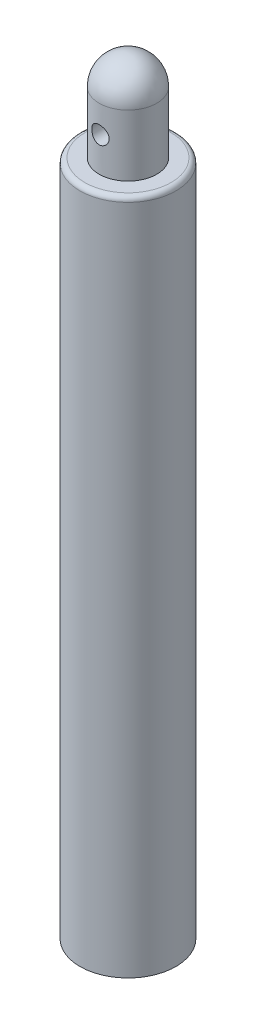
ISO-10303-21;
HEADER;
FILE_DESCRIPTION(('STEP AP214'),'2;1');
FILE_NAME('part.step','',(''),(''),'','','');
FILE_SCHEMA(('AUTOMOTIVE_DESIGN { 1 0 10303 214 1 1 1 1 }'));
ENDSEC;
DATA;
#1=APPLICATION_CONTEXT('core data for automotive mechanical design processes');
#2=APPLICATION_PROTOCOL_DEFINITION('international standard','automotive_design',2000,#1);
#3=PRODUCT_CONTEXT('',#1,'mechanical');
#4=PRODUCT('Part','Part','',(#3));
#5=PRODUCT_RELATED_PRODUCT_CATEGORY('part','',(#4));
#6=PRODUCT_DEFINITION_FORMATION('','',#4);
#7=PRODUCT_DEFINITION_CONTEXT('part definition',#1,'design');
#8=PRODUCT_DEFINITION('design','',#6,#7);
#9=PRODUCT_DEFINITION_SHAPE('','',#8);
#10=(LENGTH_UNIT() NAMED_UNIT(*) SI_UNIT(.MILLI.,.METRE.));
#11=(NAMED_UNIT(*) PLANE_ANGLE_UNIT() SI_UNIT($,.RADIAN.));
#12=(NAMED_UNIT(*) SI_UNIT($,.STERADIAN.) SOLID_ANGLE_UNIT());
#13=UNCERTAINTY_MEASURE_WITH_UNIT(LENGTH_MEASURE(1.E-05),#10,'distance_accuracy_value','');
#14=(GEOMETRIC_REPRESENTATION_CONTEXT(3) GLOBAL_UNCERTAINTY_ASSIGNED_CONTEXT((#13)) GLOBAL_UNIT_ASSIGNED_CONTEXT((#10,
#11,#12)) REPRESENTATION_CONTEXT('',''));
#15=CARTESIAN_POINT('',(0.,0.,0.));
#16=DIRECTION('',(0.,0.,1.));
#17=DIRECTION('',(1.,0.,0.));
#18=AXIS2_PLACEMENT_3D('',#15,#16,#17);
#19=CARTESIAN_POINT('',(0.,69.85,0.));
#20=DIRECTION('',(0.,-1.,0.));
#21=DIRECTION('',(0.,0.,-1.));
#22=AXIS2_PLACEMENT_3D('',#19,#20,#21);
#23=CYLINDRICAL_SURFACE('',#22,4.955);
#24=CARTESIAN_POINT('',(0.,69.35,0.));
#25=DIRECTION('',(0.,1.,0.));
#26=DIRECTION('',(0.,0.,1.));
#27=AXIS2_PLACEMENT_3D('',#24,#25,#26);
#28=CIRCLE('',#27,4.955);
#29=CARTESIAN_POINT('',(0.,69.35,4.955));
#30=VERTEX_POINT('',#29);
#31=EDGE_CURVE('E10',#30,#30,#28,.F.);
#32=ORIENTED_EDGE('',*,*,#31,.T.);
#33=EDGE_LOOP('',(#32));
#34=FACE_BOUND('',#33,.T.);
#35=CARTESIAN_POINT('',(0.,0.,0.));
#36=DIRECTION('',(0.,1.,0.));
#37=DIRECTION('',(0.,0.,1.));
#38=AXIS2_PLACEMENT_3D('',#35,#36,#37);
#39=CIRCLE('',#38,4.955);
#40=CARTESIAN_POINT('',(0.,0.,4.955));
#41=VERTEX_POINT('',#40);
#42=EDGE_CURVE('E48',#41,#41,#39,.T.);
#43=ORIENTED_EDGE('',*,*,#42,.T.);
#44=EDGE_LOOP('',(#43));
#45=FACE_BOUND('',#44,.T.);
#46=ADVANCED_FACE('F33',(#34,#45),#23,.T.);
#47=CARTESIAN_POINT('',(0.,69.85,0.));
#48=DIRECTION('',(0.,1.,0.));
#49=DIRECTION('',(0.,0.,1.));
#50=AXIS2_PLACEMENT_3D('',#47,#48,#49);
#51=PLANE('',#50);
#52=CARTESIAN_POINT('',(0.,69.85,0.));
#53=DIRECTION('',(0.,1.,0.));
#54=DIRECTION('',(0.,0.,1.));
#55=AXIS2_PLACEMENT_3D('',#52,#53,#54);
#56=CIRCLE('',#55,4.455);
#57=CARTESIAN_POINT('',(0.,69.85,4.455));
#58=VERTEX_POINT('',#57);
#59=EDGE_CURVE('E40',#58,#58,#56,.T.);
#60=ORIENTED_EDGE('',*,*,#59,.T.);
#61=EDGE_LOOP('',(#60));
#62=FACE_BOUND('',#61,.T.);
#63=CARTESIAN_POINT('',(0.,69.85,0.));
#64=DIRECTION('',(0.,1.,0.));
#65=DIRECTION('',(0.,0.,1.));
#66=AXIS2_PLACEMENT_3D('',#63,#64,#65);
#67=CIRCLE('',#66,2.975);
#68=CARTESIAN_POINT('',(0.,69.85,2.975));
#69=VERTEX_POINT('',#68);
#70=EDGE_CURVE('E44',#69,#69,#67,.T.);
#71=ORIENTED_EDGE('',*,*,#70,.F.);
#72=EDGE_LOOP('',(#71));
#73=FACE_BOUND('',#72,.T.);
#74=ADVANCED_FACE('F82',(#62,#73),#51,.T.);
#75=CARTESIAN_POINT('',(0.,0.,0.));
#76=DIRECTION('',(0.,1.,0.));
#77=DIRECTION('',(0.,0.,1.));
#78=AXIS2_PLACEMENT_3D('',#75,#76,#77);
#79=PLANE('',#78);
#80=CARTESIAN_POINT('',(0.,0.,0.));
#81=DIRECTION('',(0.,-1.,0.));
#82=DIRECTION('',(0.,0.,-1.));
#83=AXIS2_PLACEMENT_3D('',#80,#81,#82);
#84=CIRCLE('',#83,1.);
#85=CARTESIAN_POINT('',(0.,0.,-1.));
#86=VERTEX_POINT('',#85);
#87=EDGE_CURVE('E109',#86,#86,#84,.T.);
#88=ORIENTED_EDGE('',*,*,#87,.F.);
#89=EDGE_LOOP('',(#88));
#90=FACE_BOUND('',#89,.T.);
#91=ORIENTED_EDGE('',*,*,#42,.F.);
#92=EDGE_LOOP('',(#91));
#93=FACE_BOUND('',#92,.T.);
#94=ADVANCED_FACE('F86',(#90,#93),#79,.F.);
#95=CARTESIAN_POINT('',(0.,76.2,0.));
#96=DIRECTION('',(0.,-1.,0.));
#97=DIRECTION('',(0.,0.,-1.));
#98=AXIS2_PLACEMENT_3D('',#95,#96,#97);
#99=CYLINDRICAL_SURFACE('',#98,2.975);
#100=CARTESIAN_POINT('',(0.,74.29,-2.975));
#101=CARTESIAN_POINT('',(-0.0493538924659117,74.2899994544483,-2.97499960875373));
#102=CARTESIAN_POINT('',(-0.0987133090881732,74.2859268791825,-2.97376015133276));
#103=CARTESIAN_POINT('',(-0.195993540024951,74.269783647307,-2.96893686895155));
#104=CARTESIAN_POINT('',(-0.243913941910268,74.2577107201975,-2.96535237847465));
#105=CARTESIAN_POINT('',(-0.336899028888832,74.2260076534678,-2.95623155593392));
#106=CARTESIAN_POINT('',(-0.381967852646459,74.2063887730066,-2.95069813286341));
#107=CARTESIAN_POINT('',(-0.468176180339112,74.1601972232471,-2.93825382177788));
#108=CARTESIAN_POINT('',(-0.509315140917602,74.1336235942551,-2.93134274369009));
#109=CARTESIAN_POINT('',(-0.587694983809034,74.0734609938962,-2.91665434429983));
#110=CARTESIAN_POINT('',(-0.624805183880234,74.0397061710603,-2.90885904541582));
#111=CARTESIAN_POINT('',(-0.692933845725512,73.9664927728547,-2.89338740323337));
#112=CARTESIAN_POINT('',(-0.72395126131407,73.9270332199476,-2.88571108057228));
#113=CARTESIAN_POINT('',(-0.779705718516785,73.8424196399157,-2.87115579553974));
#114=CARTESIAN_POINT('',(-0.804282507982123,73.7971558186793,-2.86429914298833));
#115=CARTESIAN_POINT('',(-0.845421819673615,73.7028967017116,-2.85242856033148));
#116=CARTESIAN_POINT('',(-0.861986303202129,73.6539023225718,-2.84741417933563));
#117=CARTESIAN_POINT('',(-0.886158181467358,73.555041758686,-2.83998337151754));
#118=CARTESIAN_POINT('',(-0.894006798399969,73.505239941856,-2.83749714916032));
#119=CARTESIAN_POINT('',(-0.901277468543076,73.4049691266538,-2.83519660432944));
#120=CARTESIAN_POINT('',(-0.900701602363047,73.3545002960913,-2.83538162213472));
#121=CARTESIAN_POINT('',(-0.891328963434268,73.2562963766513,-2.83834084649471));
#122=CARTESIAN_POINT('',(-0.88283527634089,73.2085290064907,-2.8410195907651));
#123=CARTESIAN_POINT('',(-0.858358129966997,73.1151317315911,-2.84850987369754));
#124=CARTESIAN_POINT('',(-0.842373920253746,73.069502041518,-2.85332162605089));
#125=CARTESIAN_POINT('',(-0.80314805561763,72.9809378931956,-2.86461134328623));
#126=CARTESIAN_POINT('',(-0.779808726659036,72.9380496472266,-2.87111151271954));
#127=CARTESIAN_POINT('',(-0.726603018030713,72.8566972603875,-2.88503508504516));
#128=CARTESIAN_POINT('',(-0.696735033670319,72.8182342107488,-2.89245871472289));
#129=CARTESIAN_POINT('',(-0.629818174738229,72.7451061041723,-2.90777907465328));
#130=CARTESIAN_POINT('',(-0.592518040084266,72.7106719682301,-2.91568250202471));
#131=CARTESIAN_POINT('',(-0.512574254626524,72.648493410789,-2.93079259157154));
#132=CARTESIAN_POINT('',(-0.469930256342886,72.6207494246544,-2.93799920838343));
#133=CARTESIAN_POINT('',(-0.380084529400247,72.5725952965835,-2.95097140817586));
#134=CARTESIAN_POINT('',(-0.332853347365435,72.5522371477327,-2.95672669120734));
#135=CARTESIAN_POINT('',(-0.23542279639094,72.5198219207802,-2.96607351032513));
#136=CARTESIAN_POINT('',(-0.18522427427138,72.5077624866903,-2.96966566048424));
#137=CARTESIAN_POINT('',(-0.085246511826073,72.4926732298193,-2.97418401441247));
#138=CARTESIAN_POINT('',(-0.0355185981495156,72.4893305123255,-2.97520255673052));
#139=CARTESIAN_POINT('',(0.0637912694267338,72.4908915413013,-2.97473027115334));
#140=CARTESIAN_POINT('',(0.113373242254575,72.4957941664765,-2.97323978446411));
#141=CARTESIAN_POINT('',(0.209797655374504,72.5134540656328,-2.96797740679089));
#142=CARTESIAN_POINT('',(0.256676890086767,72.5260278411683,-2.96425884870936));
#143=CARTESIAN_POINT('',(0.347649547904485,72.5584517205736,-2.95497163819599));
#144=CARTESIAN_POINT('',(0.391742633391964,72.5783027043008,-2.94940276205738));
#145=CARTESIAN_POINT('',(0.477037386490417,72.6252384294981,-2.9368288294005));
#146=CARTESIAN_POINT('',(0.518147298658479,72.6524815110455,-2.92979322678919));
#147=CARTESIAN_POINT('',(0.595318261473104,72.7132361808543,-2.91509295242122));
#148=CARTESIAN_POINT('',(0.631378021591701,72.746749366301,-2.90742812066067));
#149=CARTESIAN_POINT('',(0.698807247989637,72.8205633730886,-2.89197778519192));
#150=CARTESIAN_POINT('',(0.729954013874499,72.8610693366059,-2.88419829726305));
#151=CARTESIAN_POINT('',(0.785024689250296,72.9469020994603,-2.86969947116052));
#152=CARTESIAN_POINT('',(0.808948774720891,72.9922287813048,-2.86298010715898));
#153=CARTESIAN_POINT('',(0.848733962083619,73.0862813704306,-2.85143919210159));
#154=CARTESIAN_POINT('',(0.864631486034764,73.1349907606885,-2.8466090910791));
#155=CARTESIAN_POINT('',(0.887949153883874,73.2345691072449,-2.83942301524453));
#156=CARTESIAN_POINT('',(0.895372265579273,73.2854373010387,-2.83706617430313));
#157=CARTESIAN_POINT('',(0.901326335754701,73.3855729009132,-2.83517978487256));
#158=CARTESIAN_POINT('',(0.900220779370863,73.4348167962997,-2.83553465892088));
#159=CARTESIAN_POINT('',(0.890018490290975,73.5323819146612,-2.83875325855457));
#160=CARTESIAN_POINT('',(0.880922087759302,73.580703175673,-2.84161688048393));
#161=CARTESIAN_POINT('',(0.855232722777554,73.6744461057478,-2.84945213767348));
#162=CARTESIAN_POINT('',(0.838737545840673,73.7198970454942,-2.85439622546337));
#163=CARTESIAN_POINT('',(0.798795152767589,73.8074226059383,-2.86582987688364));
#164=CARTESIAN_POINT('',(0.775346588832439,73.8494965700544,-2.87231974008897));
#165=CARTESIAN_POINT('',(0.721148187603958,73.9307566591937,-2.88641312873204));
#166=CARTESIAN_POINT('',(0.690160478204201,73.9697785223715,-2.89404895525363));
#167=CARTESIAN_POINT('',(0.622189657329324,74.0421862182664,-2.90941872543171));
#168=CARTESIAN_POINT('',(0.58520498104082,74.0755705753118,-2.91715269421005));
#169=CARTESIAN_POINT('',(0.504958339869317,74.1367513517762,-2.93212463120724));
#170=CARTESIAN_POINT('',(0.461541738984861,74.1643508277354,-2.93934085246687));
#171=CARTESIAN_POINT('',(0.370466289167445,74.21182041724,-2.95220076642398));
#172=CARTESIAN_POINT('',(0.322809374500798,74.231694033034,-2.95784517131951));
#173=CARTESIAN_POINT('',(0.229661135845262,74.2614329575482,-2.9664523879998));
#174=CARTESIAN_POINT('',(0.184449673828996,74.272116208598,-2.96963098967094));
#175=CARTESIAN_POINT('',(0.0928269632958508,74.2863993709775,-2.97390479864906));
#176=CARTESIAN_POINT('',(0.046415924668691,74.2900005130757,-2.97500036795593));
#177=CARTESIAN_POINT('',(0.,74.29,-2.975));
#178=B_SPLINE_CURVE_WITH_KNOTS('',3,(#100,#101,#102,#103,#104,#105,#106,#107,#108,#109,#110,
#111,#112,#113,#114,#115,#116,#117,#118,#119,#120,#121,#122,#123,#124,#125,#126,#127,#128,#129,
#130,#131,#132,#133,#134,#135,#136,#137,#138,#139,#140,#141,#142,#143,#144,#145,#146,#147,#148,
#149,#150,#151,#152,#153,#154,#155,#156,#157,#158,#159,#160,#161,#162,#163,#164,#165,#166,#167,
#168,#169,#170,#171,#172,#173,#174,#175,#176,#177),.UNSPECIFIED.,.T.,.F.,(4,2,2,2,2,2,2,2,2,2,2,
2,2,2,2,2,2,2,2,2,2,2,2,2,2,2,2,2,2,2,2,2,2,2,2,2,2,2,4),(0.,0.147891158625831,
0.295824306745459,0.443537577853369,0.591271242840275,0.742883169478673,0.894521106526044,
1.04963481563183,1.2047105357944,1.35537821451222,1.50600868319566,1.65110002602045,
1.7962059078279,1.94332628785269,2.09048286962013,2.24389428119289,2.39731567338399,
2.5517970384032,2.7062345283646,2.85504679675063,3.00383882960454,3.14920407836804,
3.29458690844883,3.44337030748751,3.59219165788802,3.74651522572482,3.90083503318464,
4.05444814572996,4.20800744538858,4.3550594953227,4.50210546967183,4.64726280304184,
4.79244829116965,4.943001106331,5.09359326926706,5.2486884987661,5.40371333905262,
5.5428249227541,5.68191232873091),.UNSPECIFIED.);
#179=CARTESIAN_POINT('',(0.,74.29,-2.975));
#180=VERTEX_POINT('',#179);
#181=EDGE_CURVE('E60',#180,#180,#178,.T.);
#182=ORIENTED_EDGE('',*,*,#181,.T.);
#183=EDGE_LOOP('',(#182));
#184=FACE_BOUND('',#183,.T.);
#185=CARTESIAN_POINT('',(0.899999999999999,73.39,2.83559958386229));
#186=CARTESIAN_POINT('',(0.899999439432204,73.3407044494433,2.83560005632211));
#187=CARTESIAN_POINT('',(0.895936145447259,73.2914033554005,2.83689912052607));
#188=CARTESIAN_POINT('',(0.879833118656581,73.1942439281369,2.84193381760332));
#189=CARTESIAN_POINT('',(0.867790823425812,73.1463860635674,2.84567023321651));
#190=CARTESIAN_POINT('',(0.836177226741544,73.0535338654722,2.85511856244178));
#191=CARTESIAN_POINT('',(0.8166186056534,73.0085348571287,2.86082714728961));
#192=CARTESIAN_POINT('',(0.770569352000035,72.922445480287,2.8735720703129));
#193=CARTESIAN_POINT('',(0.744077643885241,72.8813557195914,2.8806086144512));
#194=CARTESIAN_POINT('',(0.684001338517167,72.8029287949999,2.89547059850883));
#195=CARTESIAN_POINT('',(0.650232418654725,72.7657360178587,2.90331306078141));
#196=CARTESIAN_POINT('',(0.576955153735612,72.6974455959251,2.91875793344252));
#197=CARTESIAN_POINT('',(0.537446059737952,72.6663487477359,2.92636031234871));
#198=CARTESIAN_POINT('',(0.452780748946194,72.6105039068376,2.94066206214821));
#199=CARTESIAN_POINT('',(0.407523120287281,72.5859034260449,2.9473390418085));
#200=CARTESIAN_POINT('',(0.31327685407504,72.5447186919514,2.95883970584629));
#201=CARTESIAN_POINT('',(0.264289038211678,72.5281326790937,2.96366379697322));
#202=CARTESIAN_POINT('',(0.165483785585558,72.503926369228,2.97079468610525));
#203=CARTESIAN_POINT('',(0.115731819189544,72.4960595521602,2.97317055802265));
#204=CARTESIAN_POINT('',(0.0155612380145653,72.4887351298804,2.97538070543984));
#205=CARTESIAN_POINT('',(-0.0348572321613802,72.4892757295895,2.97521552348352));
#206=CARTESIAN_POINT('',(-0.133199052475373,72.4985859798233,2.97241085498226));
#207=CARTESIAN_POINT('',(-0.181150333317985,72.5070886142764,2.9698516573841));
#208=CARTESIAN_POINT('',(-0.274910436628302,72.5316450148913,2.96264432445602));
#209=CARTESIAN_POINT('',(-0.320719122350959,72.5476992622923,2.9579960559974));
#210=CARTESIAN_POINT('',(-0.409524704956143,72.5870821234925,2.94702251063879));
#211=CARTESIAN_POINT('',(-0.452482164400859,72.6104941266448,2.94067814062821));
#212=CARTESIAN_POINT('',(-0.533943623515148,72.6638617701451,2.92698444053846));
#213=CARTESIAN_POINT('',(-0.572446549082189,72.6938189837025,2.91963486900777));
#214=CARTESIAN_POINT('',(-0.645499230650431,72.7608087406788,2.90437665711018));
#215=CARTESIAN_POINT('',(-0.679835056469484,72.7980724684774,2.89645739440677));
#216=CARTESIAN_POINT('',(-0.741831422856004,72.877905601668,2.88120341445876));
#217=CARTESIAN_POINT('',(-0.769491276542101,72.920475552327,2.87386875741537));
#218=CARTESIAN_POINT('',(-0.817578712566594,73.0102841512614,2.86056312073841));
#219=CARTESIAN_POINT('',(-0.837932017963144,73.057564830894,2.85460635388627));
#220=CARTESIAN_POINT('',(-0.870323390132549,73.1551050517514,2.84489919202199));
#221=CARTESIAN_POINT('',(-0.882364223605043,73.2053635957789,2.8411480629533));
#222=CARTESIAN_POINT('',(-0.897386428270994,73.3053941388825,2.83643836759132));
#223=CARTESIAN_POINT('',(-0.900693472382804,73.3551125431071,2.83537946990161));
#224=CARTESIAN_POINT('',(-0.899064640164192,73.4543957020626,2.83589646716383));
#225=CARTESIAN_POINT('',(-0.894129941073505,73.5039604777246,2.83747198581925));
#226=CARTESIAN_POINT('',(-0.876447940239687,73.6001623818805,2.84298170763835));
#227=CARTESIAN_POINT('',(-0.863911561966481,73.6468423018188,2.84685217097459));
#228=CARTESIAN_POINT('',(-0.831627246304974,73.7374325941848,2.85644934235893));
#229=CARTESIAN_POINT('',(-0.811878182713559,73.7813425328457,2.86217634027434));
#230=CARTESIAN_POINT('',(-0.765114771623089,73.866467892648,2.87503496179511));
#231=CARTESIAN_POINT('',(-0.737917353529593,73.9075774823701,2.88220056581329));
#232=CARTESIAN_POINT('',(-0.677245939756587,73.9847681715829,2.89705655363179));
#233=CARTESIAN_POINT('',(-0.643770416189823,74.0208480432692,2.90474706488711));
#234=CARTESIAN_POINT('',(-0.569959971706968,74.0883855878864,2.92014438130891));
#235=CARTESIAN_POINT('',(-0.529410712279684,74.1196120499769,2.92784043189515));
#236=CARTESIAN_POINT('',(-0.443463705219728,74.1748236098805,2.94208421569404));
#237=CARTESIAN_POINT('',(-0.398066195358067,74.1988090625915,2.94863200517887));
#238=CARTESIAN_POINT('',(-0.304007891541728,74.2386263478964,2.95980197874116));
#239=CARTESIAN_POINT('',(-0.255374538355256,74.254518797374,2.96443842737107));
#240=CARTESIAN_POINT('',(-0.155961676531769,74.2778517454447,2.97132626816909));
#241=CARTESIAN_POINT('',(-0.105182797767729,74.2852947069596,2.97357835533638));
#242=CARTESIAN_POINT('',(-0.00505534621600697,74.2913275384831,2.97540066790667));
#243=CARTESIAN_POINT('',(0.0442714418049871,74.2902524408026,2.97507238843757));
#244=CARTESIAN_POINT('',(0.142010714413318,74.280082432429,2.97201084272341));
#245=CARTESIAN_POINT('',(0.190423252184667,74.2709879897164,2.96927771681667));
#246=CARTESIAN_POINT('',(0.284436446612657,74.2452460209724,2.96174314703705));
#247=CARTESIAN_POINT('',(0.33006231554837,74.2286832999051,2.9569649557481));
#248=CARTESIAN_POINT('',(0.417911025632378,74.1885509170689,2.94583403134336));
#249=CARTESIAN_POINT('',(0.460133300836504,74.1649800930462,2.93948103708455));
#250=CARTESIAN_POINT('',(0.541463029932274,74.1106158497221,2.92561117155489));
#251=CARTESIAN_POINT('',(0.580425300944534,74.079613221024,2.91806326757861));
#252=CARTESIAN_POINT('',(0.652706224922244,74.0116406218517,2.90275167893282));
#253=CARTESIAN_POINT('',(0.686023234256751,73.9746689195655,2.89498793218346));
#254=CARTESIAN_POINT('',(0.747088049592021,73.8944565561567,2.87984479836746));
#255=CARTESIAN_POINT('',(0.774635320969892,73.8510592533666,2.87248432047409));
#256=CARTESIAN_POINT('',(0.822011930836993,73.7600349383991,2.85928831601298));
#257=CARTESIAN_POINT('',(0.84184486361977,73.7124099087546,2.85345207968237));
#258=CARTESIAN_POINT('',(0.871509812944171,73.6193544361324,2.84452287201841));
#259=CARTESIAN_POINT('',(0.882163814140702,73.5742061743084,2.84120866250692));
#260=CARTESIAN_POINT('',(0.896408432995147,73.4827067399985,2.83674702275044));
#261=CARTESIAN_POINT('',(0.900000527138454,73.4363558210149,2.83559913957751));
#262=CARTESIAN_POINT('',(0.899999999999999,73.39,2.83559958386229));
#263=B_SPLINE_CURVE_WITH_KNOTS('',3,(#185,#186,#187,#188,#189,#190,#191,#192,#193,#194,#195,
#196,#197,#198,#199,#200,#201,#202,#203,#204,#205,#206,#207,#208,#209,#210,#211,#212,#213,#214,
#215,#216,#217,#218,#219,#220,#221,#222,#223,#224,#225,#226,#227,#228,#229,#230,#231,#232,#233,
#234,#235,#236,#237,#238,#239,#240,#241,#242,#243,#244,#245,#246,#247,#248,#249,#250,#251,#252,
#253,#254,#255,#256,#257,#258,#259,#260,#261,#262),.UNSPECIFIED.,.T.,.F.,(4,2,2,2,2,2,2,2,2,2,2,
2,2,2,2,2,2,2,2,2,2,2,2,2,2,2,2,2,2,2,2,2,2,2,2,2,2,2,4),(0.,0.147715604944634,
0.295478671185687,0.442993541413566,0.59053130962339,0.742371811289511,0.894232141948245,
1.04929090564767,1.2043156110882,1.35483562846839,1.5053235085596,1.65093872572673,
1.79656322372571,1.94390159752386,2.09127542466833,2.24442209436204,2.39758451439025,
2.55226258311801,2.70688914438179,2.8556626682439,3.00441494330935,3.1492174698854,
3.2940426158908,3.44280855031748,3.59161073664006,3.74613731846476,3.90065632537473,
4.05400029804457,4.20729956134331,4.35460009134372,4.50189202597708,4.64755196010528,
4.79323606459042,4.9436388253527,5.0940853012594,5.24911407551795,5.40407053141781,
5.54300619947486,5.68191281612862),.UNSPECIFIED.);
#264=CARTESIAN_POINT('',(0.899999999999999,73.39,2.83559958386229));
#265=VERTEX_POINT('',#264);
#266=EDGE_CURVE('E59',#265,#265,#263,.T.);
#267=ORIENTED_EDGE('',*,*,#266,.T.);
#268=EDGE_LOOP('',(#267));
#269=FACE_BOUND('',#268,.T.);
#270=CARTESIAN_POINT('',(0.,76.2,0.));
#271=DIRECTION('',(0.,1.,0.));
#272=DIRECTION('',(0.,0.,1.));
#273=AXIS2_PLACEMENT_3D('',#270,#271,#272);
#274=CIRCLE('',#273,2.975);
#275=CARTESIAN_POINT('',(0.,76.2,2.975));
#276=VERTEX_POINT('',#275);
#277=EDGE_CURVE('E105',#276,#276,#274,.T.);
#278=ORIENTED_EDGE('',*,*,#277,.F.);
#279=EDGE_LOOP('',(#278));
#280=FACE_BOUND('',#279,.T.);
#281=ORIENTED_EDGE('',*,*,#70,.T.);
#282=EDGE_LOOP('',(#281));
#283=FACE_BOUND('',#282,.T.);
#284=ADVANCED_FACE('F91',(#184,#269,#280,#283),#99,.T.);
#285=CARTESIAN_POINT('',(0.,20.,0.));
#286=DIRECTION('',(0.,-1.,0.));
#287=DIRECTION('',(0.,0.,-1.));
#288=AXIS2_PLACEMENT_3D('',#285,#286,#287);
#289=CYLINDRICAL_SURFACE('',#288,1.);
#290=CARTESIAN_POINT('',(0.,20.,0.));
#291=DIRECTION('',(0.,-1.,0.));
#292=DIRECTION('',(0.,0.,-1.));
#293=AXIS2_PLACEMENT_3D('',#290,#291,#292);
#294=CIRCLE('',#293,1.);
#295=CARTESIAN_POINT('',(0.,20.,-1.));
#296=VERTEX_POINT('',#295);
#297=EDGE_CURVE('E108',#296,#296,#294,.T.);
#298=ORIENTED_EDGE('',*,*,#297,.F.);
#299=EDGE_LOOP('',(#298));
#300=FACE_BOUND('',#299,.T.);
#301=ORIENTED_EDGE('',*,*,#87,.T.);
#302=EDGE_LOOP('',(#301));
#303=FACE_BOUND('',#302,.T.);
#304=ADVANCED_FACE('F96',(#300,#303),#289,.F.);
#305=CARTESIAN_POINT('',(0.,20.,0.));
#306=DIRECTION('',(0.,-1.,0.));
#307=DIRECTION('',(0.,0.,-1.));
#308=AXIS2_PLACEMENT_3D('',#305,#306,#307);
#309=PLANE('',#308);
#310=ORIENTED_EDGE('',*,*,#297,.T.);
#311=EDGE_LOOP('',(#310));
#312=FACE_BOUND('',#311,.T.);
#313=ADVANCED_FACE('F115',(#312),#309,.T.);
#314=CARTESIAN_POINT('',(0.,73.39,-4.955));
#315=DIRECTION('',(0.,0.,1.));
#316=DIRECTION('',(1.,0.,0.));
#317=AXIS2_PLACEMENT_3D('',#314,#315,#316);
#318=CYLINDRICAL_SURFACE('',#317,0.899999999999999);
#319=CARTESIAN_POINT('',(0.899632523568646,73.3642838078292,0.));
#320=CARTESIAN_POINT('',(0.899634088262646,73.3642846054179,-0.076102913289735));
#321=CARTESIAN_POINT('',(0.899737574803172,73.3673837191333,-0.152231479451245));
#322=CARTESIAN_POINT('',(0.899961509341407,73.37970414633,-0.304022426939057));
#323=CARTESIAN_POINT('',(0.90008196788897,73.3889292811111,-0.379684487516651));
#324=CARTESIAN_POINT('',(0.899780645912804,73.4133096354593,-0.530296545836144));
#325=CARTESIAN_POINT('',(0.899357105936551,73.4284839860742,-0.605243439271529));
#326=CARTESIAN_POINT('',(0.89710003108189,73.4643953989738,-0.753750413174285));
#327=CARTESIAN_POINT('',(0.895266852445882,73.4851310549494,-0.827310839216956));
#328=CARTESIAN_POINT('',(0.889494065466864,73.528617489136,-0.963087244761712));
#329=CARTESIAN_POINT('',(0.885864694726194,73.5507402572079,-1.02551820190751));
#330=CARTESIAN_POINT('',(0.875868212586727,73.5984442003527,-1.14881693909608));
#331=CARTESIAN_POINT('',(0.869501592829798,73.6240247538015,-1.20968499777412));
#332=CARTESIAN_POINT('',(0.853106821560963,73.6781057439446,-1.32937916738041));
#333=CARTESIAN_POINT('',(0.843090515553861,73.7065965222488,-1.3882112175344));
#334=CARTESIAN_POINT('',(0.818339012917693,73.7659725518043,-1.50360074063423));
#335=CARTESIAN_POINT('',(0.803607477880371,73.7968559310325,-1.56015994031989));
#336=CARTESIAN_POINT('',(0.767837091240347,73.8609610563359,-1.67167612015994));
#337=CARTESIAN_POINT('',(0.746668030770805,73.8942190510098,-1.72657150054248));
#338=CARTESIAN_POINT('',(0.696679637857359,73.9613029192311,-1.83249677185712));
#339=CARTESIAN_POINT('',(0.667862118877974,73.9951286563872,-1.8835275754063));
#340=CARTESIAN_POINT('',(0.607392862566376,74.0552278047536,-1.97094891803156));
#341=CARTESIAN_POINT('',(0.577325355426825,74.0817129622614,-2.00827702210747));
#342=CARTESIAN_POINT('',(0.510399348142647,74.1324610137881,-2.07806798470387));
#343=CARTESIAN_POINT('',(0.473554607355382,74.1567282638761,-2.11054046336246));
#344=CARTESIAN_POINT('',(0.404341900109814,74.194727634953,-2.16044666076909));
#345=CARTESIAN_POINT('',(0.373726962428657,74.2094838578533,-2.17952112966812));
#346=CARTESIAN_POINT('',(0.309019375803281,74.2360062923557,-2.21345158709295));
#347=CARTESIAN_POINT('',(0.274928445677037,74.247773971788,-2.22830964694073));
#348=CARTESIAN_POINT('',(0.203489718862358,74.2674828238116,-2.25302792555032));
#349=CARTESIAN_POINT('',(0.166113050314495,74.2753850075873,-2.26283727065471));
#350=CARTESIAN_POINT('',(0.0895957378834002,74.2863593702473,-2.2764255330879));
#351=CARTESIAN_POINT('',(0.0504571200527109,74.2894369579786,-2.28021120362035));
#352=CARTESIAN_POINT('',(-0.0221797685135232,74.290349806225,-2.28133500843057));
#353=CARTESIAN_POINT('',(-0.0556599848381693,74.2888902473288,-2.27954043219711));
#354=CARTESIAN_POINT('',(-0.1217055556917,74.2823499557444,-2.27146384085728));
#355=CARTESIAN_POINT('',(-0.154270905539243,74.2772692045302,-2.26518180279306));
#356=CARTESIAN_POINT('',(-0.216776093831129,74.2640725481825,-2.24875012191265));
#357=CARTESIAN_POINT('',(-0.246762773864745,74.2560411396822,-2.23870801408249));
#358=CARTESIAN_POINT('',(-0.304537803409586,74.2374546072217,-2.21525563593057));
#359=CARTESIAN_POINT('',(-0.332325348511707,74.226898565417,-2.20184414055932));
#360=CARTESIAN_POINT('',(-0.398137401122539,74.1982808222611,-2.16507287901919));
#361=CARTESIAN_POINT('',(-0.43470749238058,74.1790430924701,-2.14002191839141));
#362=CARTESIAN_POINT('',(-0.502339458433708,74.1378183345274,-2.0851907935858));
#363=CARTESIAN_POINT('',(-0.533388054917802,74.1158248899739,-2.05539954695141));
#364=CARTESIAN_POINT('',(-0.604208545047913,74.0592353437494,-1.9768214085981));
#365=CARTESIAN_POINT('',(-0.640830496378168,74.0237320430423,-1.92586526808335));
#366=CARTESIAN_POINT('',(-0.704383535863703,73.9522609436463,-1.81860548569918));
#367=CARTESIAN_POINT('',(-0.73129733042556,73.9162924331263,-1.76229252469608));
#368=CARTESIAN_POINT('',(-0.773285041327692,73.8517797131977,-1.65591330181651));
#369=CARTESIAN_POINT('',(-0.789601313750761,73.823026730185,-1.6064494538395));
#370=CARTESIAN_POINT('',(-0.817798011834255,73.7670766006082,-1.50540874501755));
#371=CARTESIAN_POINT('',(-0.829675568256259,73.7398804699956,-1.45383054124632));
#372=CARTESIAN_POINT('',(-0.859974937789043,73.661318989007,-1.29628140471858));
#373=CARTESIAN_POINT('',(-0.873000877387843,73.6130905152329,-1.18767347338055));
#374=CARTESIAN_POINT('',(-0.887784425724307,73.5408279622423,-0.999112730332888));
#375=CARTESIAN_POINT('',(-0.891754648326795,73.5138823495086,-0.920385555252119));
#376=CARTESIAN_POINT('',(-0.897092228282405,73.4661847773202,-0.760939667062752));
#377=CARTESIAN_POINT('',(-0.898458742327469,73.4454348263959,-0.68022031728582));
#378=CARTESIAN_POINT('',(-0.899928140002291,73.4107532316111,-0.517466529301141));
#379=CARTESIAN_POINT('',(-0.900033199262823,73.3968098882658,-0.435434599728592));
#380=CARTESIAN_POINT('',(-0.899952804501816,73.3760916514885,-0.270478513641278));
#381=CARTESIAN_POINT('',(-0.899767406132918,73.3693153852375,-0.187554531070039));
#382=CARTESIAN_POINT('',(-0.899604786269482,73.3631481944578,-0.0217077738184924));
#383=CARTESIAN_POINT('',(-0.899626871998157,73.3637326950009,0.061214081072949));
#384=CARTESIAN_POINT('',(-0.899833852757138,73.372209389237,0.226690463910219));
#385=CARTESIAN_POINT('',(-0.90001876735393,73.3801024611772,0.309244946512127));
#386=CARTESIAN_POINT('',(-0.899978592143726,73.4029799742356,0.473536384970677));
#387=CARTESIAN_POINT('',(-0.899752632016177,73.4179794183949,0.5552712358415));
#388=CARTESIAN_POINT('',(-0.89786270052123,73.454644112636,0.717202141520554));
#389=CARTESIAN_POINT('',(-0.896198957269398,73.476308304952,0.797398438369335));
#390=CARTESIAN_POINT('',(-0.890628276214318,73.5211099978689,0.941019773621992));
#391=CARTESIAN_POINT('',(-0.887197034230405,73.5432209604041,1.00478566782372));
#392=CARTESIAN_POINT('',(-0.877590062610097,73.591076235799,1.13072375343631));
#393=CARTESIAN_POINT('',(-0.871414880437171,73.6168198231885,1.19289626013967));
#394=CARTESIAN_POINT('',(-0.855353765548068,73.6713829414206,1.31515061268184));
#395=CARTESIAN_POINT('',(-0.84548009685262,73.7001920834379,1.37523865881723));
#396=CARTESIAN_POINT('',(-0.820915299729635,73.7603418118653,1.49308855291835));
#397=CARTESIAN_POINT('',(-0.806227952517099,73.7916803968441,1.5508521868853));
#398=CARTESIAN_POINT('',(-0.770713083795509,73.8562233962197,1.66369889603867));
#399=CARTESIAN_POINT('',(-0.749864777965999,73.889433813367,1.71877215012738));
#400=CARTESIAN_POINT('',(-0.700584351229797,73.9564917586034,1.82511038893037));
#401=CARTESIAN_POINT('',(-0.672153365025929,73.9903391906634,1.87637594197809));
#402=CARTESIAN_POINT('',(-0.612133003823431,74.0508827332475,1.96475798105191));
#403=CARTESIAN_POINT('',(-0.582046782479774,74.0777643353465,2.00275591849616));
#404=CARTESIAN_POINT('',(-0.514950170162422,74.1293298141437,2.07384048857992));
#405=CARTESIAN_POINT('',(-0.477954169893062,74.1540181038567,2.10693707674727));
#406=CARTESIAN_POINT('',(-0.408571393332795,74.1925893066954,2.1576660182547));
#407=CARTESIAN_POINT('',(-0.378009743180878,74.2075188247406,2.17698818489116));
#408=CARTESIAN_POINT('',(-0.313366824648113,74.2344073000309,2.21142264872647));
#409=CARTESIAN_POINT('',(-0.279287247677723,74.2463676755006,2.22653695624937));
#410=CARTESIAN_POINT('',(-0.207809451188721,74.2664730257626,2.25176959201895));
#411=CARTESIAN_POINT('',(-0.170381392453746,74.2745785570721,2.26183632694393));
#412=CARTESIAN_POINT('',(-0.0936951711280377,74.2859448439896,2.27591455010336));
#413=CARTESIAN_POINT('',(-0.0544391794158992,74.2892112025756,2.27993304131009));
#414=CARTESIAN_POINT('',(0.0184234566652055,74.2904375496844,2.28144313241411));
#415=CARTESIAN_POINT('',(0.0520040159104691,74.2891130199651,2.279814764043));
#416=CARTESIAN_POINT('',(0.118280619585325,74.2828141947941,2.27203781546533));
#417=CARTESIAN_POINT('',(0.150976666405507,74.2778399092077,2.26588924747687));
#418=CARTESIAN_POINT('',(0.213638483072572,74.2648445903672,2.24971413626359));
#419=CARTESIAN_POINT('',(0.24365695114046,74.2569203901122,2.23981067677437));
#420=CARTESIAN_POINT('',(0.301514639649818,74.2385352163407,2.21662523288972));
#421=CARTESIAN_POINT('',(0.329353085809705,74.2280733468736,2.20334205516838));
#422=CARTESIAN_POINT('',(0.395160442201236,74.1997333930127,2.16695471115012));
#423=CARTESIAN_POINT('',(0.431701704937407,74.1806867003247,2.14217554254381));
#424=CARTESIAN_POINT('',(0.499325765603613,74.1398287598028,2.0878946452158));
#425=CARTESIAN_POINT('',(0.530395401624681,74.1180110574129,2.05838184677434));
#426=CARTESIAN_POINT('',(0.601237251668131,74.0618896304429,1.98057917185781));
#427=CARTESIAN_POINT('',(0.637900274661508,74.0266710018695,1.93013449580171));
#428=CARTESIAN_POINT('',(0.701605277713952,73.9557120033279,1.82391465541655));
#429=CARTESIAN_POINT('',(0.728630829322294,73.9199708495544,1.76813059265959));
#430=CARTESIAN_POINT('',(0.770840503791794,73.8558407278764,1.66277620015959));
#431=CARTESIAN_POINT('',(0.787266065553586,73.8272530341918,1.61380958696935));
#432=CARTESIAN_POINT('',(0.815704479855275,73.7715787122632,1.51377236106134));
#433=CARTESIAN_POINT('',(0.827714448307007,73.7444930748732,1.46270039734297));
#434=CARTESIAN_POINT('',(0.85843106040996,73.6661576126652,1.30664937598155));
#435=CARTESIAN_POINT('',(0.871749546249773,73.6179590336769,1.19904397671808));
#436=CARTESIAN_POINT('',(0.887027701383974,73.5452861500793,1.01156795604357));
#437=CARTESIAN_POINT('',(0.891181118379553,73.5180102951985,0.932899802000733));
#438=CARTESIAN_POINT('',(0.896803282885818,73.4696234788784,0.773530276856106));
#439=CARTESIAN_POINT('',(0.898270717395653,73.4485155367621,0.692827930901327));
#440=CARTESIAN_POINT('',(0.899876719734994,73.4131287855563,0.530193825740452));
#441=CARTESIAN_POINT('',(0.900019353598946,73.3988292087295,0.448266601763676));
#442=CARTESIAN_POINT('',(0.899976658229752,73.3773821595565,0.283522845881724));
#443=CARTESIAN_POINT('',(0.899791596460492,73.3702288618986,0.200707094019292));
#444=CARTESIAN_POINT('',(0.899677940715266,73.3659292525577,0.098151875706929));
#445=CARTESIAN_POINT('',(0.899661410650217,73.3653124457986,0.0785262338456417));
#446=CARTESIAN_POINT('',(0.899638500588515,73.3644896350479,0.0392676301057643));
#447=CARTESIAN_POINT('',(0.899632119875183,73.3642836020501,0.0196346688419542));
#448=CARTESIAN_POINT('',(0.899632523568646,73.3642838078292,0.));
#449=B_SPLINE_CURVE_WITH_KNOTS('',3,(#319,#320,#321,#322,#323,#324,#325,#326,#327,#328,#329,
#330,#331,#332,#333,#334,#335,#336,#337,#338,#339,#340,#341,#342,#343,#344,#345,#346,#347,#348,
#349,#350,#351,#352,#353,#354,#355,#356,#357,#358,#359,#360,#361,#362,#363,#364,#365,#366,#367,
#368,#369,#370,#371,#372,#373,#374,#375,#376,#377,#378,#379,#380,#381,#382,#383,#384,#385,#386,
#387,#388,#389,#390,#391,#392,#393,#394,#395,#396,#397,#398,#399,#400,#401,#402,#403,#404,#405,
#406,#407,#408,#409,#410,#411,#412,#413,#414,#415,#416,#417,#418,#419,#420,#421,#422,#423,#424,
#425,#426,#427,#428,#429,#430,#431,#432,#433,#434,#435,#436,#437,#438,#439,#440,#441,#442,#443,
#444,#445,#446,#447,#448),.UNSPECIFIED.,.T.,.F.,(4,2,2,2,2,2,2,2,2,2,2,2,2,2,2,2,2,2,2,2,2,2,2,
2,2,2,2,2,2,2,2,2,2,2,2,2,2,2,2,2,2,2,2,2,2,2,2,2,2,2,2,2,2,2,2,2,2,2,2,2,2,2,2,2,4),(0.,
0.22829117790895,0.456724893607425,0.68589929547237,0.915015799650054,1.11386702894334,
1.31268255714629,1.51085847064124,1.70888086329235,1.91121002171674,2.11349125029036,
2.27725963148685,2.44069912290413,2.55720209660958,2.67364773845517,2.79124484529734,
2.90871001968382,3.00887904599793,3.1090485847804,3.20654856543814,3.30408404679016,
3.44823357115968,3.59272519742332,3.80781486488344,4.02328581121993,4.20151771264263,
4.37986462679979,4.73720525495665,4.98688097180928,5.23663754171129,5.48596329451694,
5.73524128152748,5.9836872410936,6.23216305947797,6.48116581604489,6.73012907362327,
6.93270665122235,7.13524382923047,7.33711526403876,7.53882850441947,7.74123015843112,
7.94360154122205,8.10934283493272,8.27474271942651,8.39168470963437,8.50857073401604,
8.62662831209523,8.74454909150769,8.84497178624364,8.94539420953809,9.04277534200045,
9.14019090605585,9.28363041388492,9.42741038525412,9.64106822656055,9.85508855661551,
10.0319344896057,10.2088957269092,10.5635806831083,10.813436813769,11.0634150501358,
11.3126258070734,11.5616332529204,11.6205368879971,11.6794363635102),.UNSPECIFIED.);
#450=CARTESIAN_POINT('',(0.899632523568646,73.3642838078292,0.));
#451=VERTEX_POINT('',#450);
#452=EDGE_CURVE('E51',#451,#451,#449,.T.);
#453=ORIENTED_EDGE('',*,*,#452,.T.);
#454=EDGE_LOOP('',(#453));
#455=FACE_BOUND('',#454,.T.);
#456=ORIENTED_EDGE('',*,*,#266,.F.);
#457=EDGE_LOOP('',(#456));
#458=FACE_BOUND('',#457,.T.);
#459=ORIENTED_EDGE('',*,*,#181,.F.);
#460=EDGE_LOOP('',(#459));
#461=FACE_BOUND('',#460,.T.);
#462=ADVANCED_FACE('F66',(#455,#458,#461),#318,.F.);
#463=CARTESIAN_POINT('',(0.,76.2,0.));
#464=DIRECTION('',(1.,0.,0.));
#465=DIRECTION('',(0.,-1.,0.));
#466=AXIS2_PLACEMENT_3D('',#463,#464,#465);
#467=SPHERICAL_SURFACE('',#466,2.975);
#468=ORIENTED_EDGE('',*,*,#452,.F.);
#469=EDGE_LOOP('',(#468));
#470=FACE_BOUND('',#469,.T.);
#471=ADVANCED_FACE('F72',(#470),#467,.T.);
#472=CARTESIAN_POINT('',(0.,76.2,0.));
#473=DIRECTION('',(0.,1.,0.));
#474=DIRECTION('',(0.,0.,1.));
#475=AXIS2_PLACEMENT_3D('',#472,#473,#474);
#476=SPHERICAL_SURFACE('',#475,2.975);
#477=ORIENTED_EDGE('',*,*,#277,.T.);
#478=EDGE_LOOP('',(#477));
#479=FACE_BOUND('',#478,.T.);
#480=ADVANCED_FACE('F69',(#479),#476,.T.);
#481=CARTESIAN_POINT('',(0.,69.35,0.));
#482=DIRECTION('',(0.,1.,0.));
#483=DIRECTION('',(0.,0.,1.));
#484=AXIS2_PLACEMENT_3D('',#481,#482,#483);
#485=TOROIDAL_SURFACE('',#484,4.455,0.5);
#486=ORIENTED_EDGE('',*,*,#31,.F.);
#487=EDGE_LOOP('',(#486));
#488=FACE_BOUND('',#487,.T.);
#489=ORIENTED_EDGE('',*,*,#59,.F.);
#490=EDGE_LOOP('',(#489));
#491=FACE_BOUND('',#490,.T.);
#492=ADVANCED_FACE('F35',(#488,#491),#485,.T.);
#493=CLOSED_SHELL('',(#46,#74,#94,#284,#304,#313,#462,#471,#480,#492));
#494=MANIFOLD_SOLID_BREP('B2',#493);
#495=ADVANCED_BREP_SHAPE_REPRESENTATION('',(#18,#494),#14);
#496=SHAPE_DEFINITION_REPRESENTATION(#9,#495);
ENDSEC;
END-ISO-10303-21;
